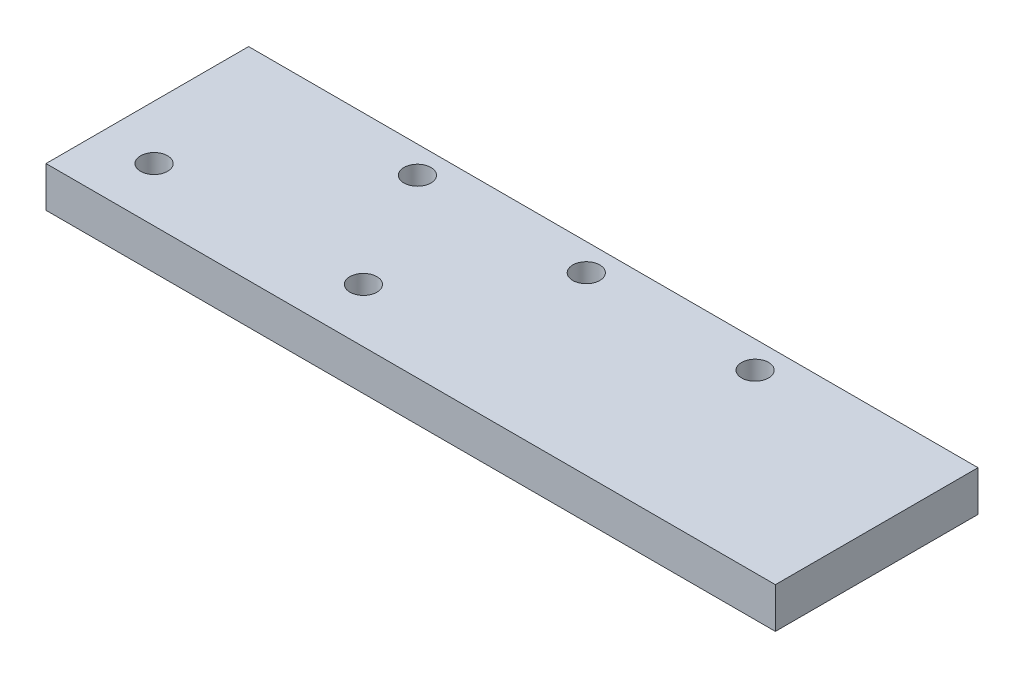
ISO-10303-21;
HEADER;
FILE_DESCRIPTION(('STEP AP214'),'2;1');
FILE_NAME('part.step','',(''),(''),'','','');
FILE_SCHEMA(('AUTOMOTIVE_DESIGN { 1 0 10303 214 1 1 1 1 }'));
ENDSEC;
DATA;
#1=APPLICATION_CONTEXT('core data for automotive mechanical design processes');
#2=APPLICATION_PROTOCOL_DEFINITION('international standard','automotive_design',2000,#1);
#3=PRODUCT_CONTEXT('',#1,'mechanical');
#4=PRODUCT('Part','Part','',(#3));
#5=PRODUCT_RELATED_PRODUCT_CATEGORY('part','',(#4));
#6=PRODUCT_DEFINITION_FORMATION('','',#4);
#7=PRODUCT_DEFINITION_CONTEXT('part definition',#1,'design');
#8=PRODUCT_DEFINITION('design','',#6,#7);
#9=PRODUCT_DEFINITION_SHAPE('','',#8);
#10=(LENGTH_UNIT() NAMED_UNIT(*) SI_UNIT(.MILLI.,.METRE.));
#11=(NAMED_UNIT(*) PLANE_ANGLE_UNIT() SI_UNIT($,.RADIAN.));
#12=(NAMED_UNIT(*) SI_UNIT($,.STERADIAN.) SOLID_ANGLE_UNIT());
#13=UNCERTAINTY_MEASURE_WITH_UNIT(LENGTH_MEASURE(1.E-05),#10,'distance_accuracy_value','');
#14=(GEOMETRIC_REPRESENTATION_CONTEXT(3) GLOBAL_UNCERTAINTY_ASSIGNED_CONTEXT((#13)) GLOBAL_UNIT_ASSIGNED_CONTEXT((#10,
#11,#12)) REPRESENTATION_CONTEXT('',''));
#15=CARTESIAN_POINT('',(0.,0.,0.));
#16=DIRECTION('',(0.,0.,1.));
#17=DIRECTION('',(1.,0.,0.));
#18=AXIS2_PLACEMENT_3D('',#15,#16,#17);
#19=CARTESIAN_POINT('',(-102.510460251046,6.,-65.1673640167364));
#20=DIRECTION('',(0.,0.,-1.));
#21=DIRECTION('',(-1.,0.,0.));
#22=AXIS2_PLACEMENT_3D('',#19,#20,#21);
#23=PLANE('',#22);
#24=DIRECTION('',(1.,0.,0.));
#25=VECTOR('',#24,1.);
#26=CARTESIAN_POINT('',(-102.510460251046,0.,-65.1673640167364));
#27=LINE('',#26,#25);
#28=CARTESIAN_POINT('',(-102.510460251046,0.,-65.1673640167364));
#29=VERTEX_POINT('',#28);
#30=CARTESIAN_POINT('',(5.48953974895393,0.,-65.1673640167364));
#31=VERTEX_POINT('',#30);
#32=EDGE_CURVE('E99',#29,#31,#27,.T.);
#33=ORIENTED_EDGE('',*,*,#32,.F.);
#34=DIRECTION('',(0.,-1.,0.));
#35=VECTOR('',#34,1.);
#36=CARTESIAN_POINT('',(-102.510460251046,6.,-65.1673640167364));
#37=LINE('',#36,#35);
#38=CARTESIAN_POINT('',(-102.510460251046,6.,-65.1673640167364));
#39=VERTEX_POINT('',#38);
#40=EDGE_CURVE('E11',#39,#29,#37,.T.);
#41=ORIENTED_EDGE('',*,*,#40,.F.);
#42=DIRECTION('',(1.,0.,0.));
#43=VECTOR('',#42,1.);
#44=CARTESIAN_POINT('',(-102.510460251046,6.,-65.1673640167364));
#45=LINE('',#44,#43);
#46=CARTESIAN_POINT('',(5.48953974895393,6.,-65.1673640167364));
#47=VERTEX_POINT('',#46);
#48=EDGE_CURVE('E93',#39,#47,#45,.T.);
#49=ORIENTED_EDGE('',*,*,#48,.T.);
#50=DIRECTION('',(0.,-1.,0.));
#51=VECTOR('',#50,1.);
#52=CARTESIAN_POINT('',(5.48953974895393,6.,-65.1673640167364));
#53=LINE('',#52,#51);
#54=EDGE_CURVE('E36',#47,#31,#53,.T.);
#55=ORIENTED_EDGE('',*,*,#54,.T.);
#56=EDGE_LOOP('',(#33,#41,#49,#55));
#57=FACE_BOUND('',#56,.T.);
#58=ADVANCED_FACE('F33',(#57),#23,.T.);
#59=CARTESIAN_POINT('',(-102.510460251046,6.,-65.1673640167364));
#60=DIRECTION('',(1.,0.,0.));
#61=DIRECTION('',(0.,0.,-1.));
#62=AXIS2_PLACEMENT_3D('',#59,#60,#61);
#63=PLANE('',#62);
#64=DIRECTION('',(0.,0.,1.));
#65=VECTOR('',#64,1.);
#66=CARTESIAN_POINT('',(-102.510460251046,0.,-65.1673640167364));
#67=LINE('',#66,#65);
#68=CARTESIAN_POINT('',(-102.510460251046,0.,-35.1673640167364));
#69=VERTEX_POINT('',#68);
#70=EDGE_CURVE('E66',#29,#69,#67,.T.);
#71=ORIENTED_EDGE('',*,*,#70,.T.);
#72=DIRECTION('',(0.,-1.,0.));
#73=VECTOR('',#72,1.);
#74=CARTESIAN_POINT('',(-102.510460251046,6.,-35.1673640167364));
#75=LINE('',#74,#73);
#76=CARTESIAN_POINT('',(-102.510460251046,6.,-35.1673640167364));
#77=VERTEX_POINT('',#76);
#78=EDGE_CURVE('E42',#77,#69,#75,.T.);
#79=ORIENTED_EDGE('',*,*,#78,.F.);
#80=DIRECTION('',(0.,0.,1.));
#81=VECTOR('',#80,1.);
#82=CARTESIAN_POINT('',(-102.510460251046,6.,-65.1673640167364));
#83=LINE('',#82,#81);
#84=EDGE_CURVE('E83',#39,#77,#83,.T.);
#85=ORIENTED_EDGE('',*,*,#84,.F.);
#86=ORIENTED_EDGE('',*,*,#40,.T.);
#87=EDGE_LOOP('',(#71,#79,#85,#86));
#88=FACE_BOUND('',#87,.T.);
#89=ADVANCED_FACE('F110',(#88),#63,.F.);
#90=CARTESIAN_POINT('',(-102.510460251046,6.,-35.1673640167364));
#91=DIRECTION('',(0.,0.,-1.));
#92=DIRECTION('',(-1.,0.,0.));
#93=AXIS2_PLACEMENT_3D('',#90,#91,#92);
#94=PLANE('',#93);
#95=DIRECTION('',(1.,0.,0.));
#96=VECTOR('',#95,1.);
#97=CARTESIAN_POINT('',(-102.510460251046,0.,-35.1673640167364));
#98=LINE('',#97,#96);
#99=CARTESIAN_POINT('',(5.48953974895393,0.,-35.1673640167364));
#100=VERTEX_POINT('',#99);
#101=EDGE_CURVE('E90',#69,#100,#98,.T.);
#102=ORIENTED_EDGE('',*,*,#101,.T.);
#103=DIRECTION('',(0.,-1.,0.));
#104=VECTOR('',#103,1.);
#105=CARTESIAN_POINT('',(5.48953974895393,6.,-35.1673640167364));
#106=LINE('',#105,#104);
#107=CARTESIAN_POINT('',(5.48953974895393,6.,-35.1673640167364));
#108=VERTEX_POINT('',#107);
#109=EDGE_CURVE('E87',#108,#100,#106,.T.);
#110=ORIENTED_EDGE('',*,*,#109,.F.);
#111=DIRECTION('',(1.,0.,0.));
#112=VECTOR('',#111,1.);
#113=CARTESIAN_POINT('',(-102.510460251046,6.,-35.1673640167364));
#114=LINE('',#113,#112);
#115=EDGE_CURVE('E78',#77,#108,#114,.T.);
#116=ORIENTED_EDGE('',*,*,#115,.F.);
#117=ORIENTED_EDGE('',*,*,#78,.T.);
#118=EDGE_LOOP('',(#102,#110,#116,#117));
#119=FACE_BOUND('',#118,.T.);
#120=ADVANCED_FACE('F88',(#119),#94,.F.);
#121=CARTESIAN_POINT('',(5.48953974895393,6.,-65.1673640167364));
#122=DIRECTION('',(1.,0.,0.));
#123=DIRECTION('',(0.,0.,-1.));
#124=AXIS2_PLACEMENT_3D('',#121,#122,#123);
#125=PLANE('',#124);
#126=DIRECTION('',(0.,0.,1.));
#127=VECTOR('',#126,1.);
#128=CARTESIAN_POINT('',(5.48953974895393,0.,-65.1673640167364));
#129=LINE('',#128,#127);
#130=EDGE_CURVE('E102',#31,#100,#129,.T.);
#131=ORIENTED_EDGE('',*,*,#130,.F.);
#132=ORIENTED_EDGE('',*,*,#54,.F.);
#133=DIRECTION('',(0.,0.,1.));
#134=VECTOR('',#133,1.);
#135=CARTESIAN_POINT('',(5.48953974895393,6.,-65.1673640167364));
#136=LINE('',#135,#134);
#137=EDGE_CURVE('E82',#47,#108,#136,.T.);
#138=ORIENTED_EDGE('',*,*,#137,.T.);
#139=ORIENTED_EDGE('',*,*,#109,.T.);
#140=EDGE_LOOP('',(#131,#132,#138,#139));
#141=FACE_BOUND('',#140,.T.);
#142=ADVANCED_FACE('F92',(#141),#125,.T.);
#143=CARTESIAN_POINT('',(0.,6.,0.));
#144=DIRECTION('',(0.,-1.,0.));
#145=DIRECTION('',(0.,0.,-1.));
#146=AXIS2_PLACEMENT_3D('',#143,#144,#145);
#147=PLANE('',#146);
#148=CARTESIAN_POINT('',(-63.5104602510461,6.,-43.1673640167364));
#149=DIRECTION('',(0.,-1.,0.));
#150=DIRECTION('',(0.,0.,-1.));
#151=AXIS2_PLACEMENT_3D('',#148,#149,#150);
#152=CIRCLE('',#151,2.);
#153=CARTESIAN_POINT('',(-63.5104602510461,6.,-45.1673640167364));
#154=VERTEX_POINT('',#153);
#155=EDGE_CURVE('E103',#154,#154,#152,.T.);
#156=ORIENTED_EDGE('',*,*,#155,.T.);
#157=EDGE_LOOP('',(#156));
#158=FACE_BOUND('',#157,.T.);
#159=CARTESIAN_POINT('',(-94.5104602510461,6.,-43.1673640167364));
#160=DIRECTION('',(0.,-1.,0.));
#161=DIRECTION('',(0.,0.,-1.));
#162=AXIS2_PLACEMENT_3D('',#159,#160,#161);
#163=CIRCLE('',#162,2.);
#164=CARTESIAN_POINT('',(-94.5104602510461,6.,-45.1673640167364));
#165=VERTEX_POINT('',#164);
#166=EDGE_CURVE('E166',#165,#165,#163,.T.);
#167=ORIENTED_EDGE('',*,*,#166,.T.);
#168=EDGE_LOOP('',(#167));
#169=FACE_BOUND('',#168,.T.);
#170=CARTESIAN_POINT('',(-23.5104602510461,6.,-61.1673640167364));
#171=DIRECTION('',(0.,-1.,0.));
#172=DIRECTION('',(0.,0.,-1.));
#173=AXIS2_PLACEMENT_3D('',#170,#171,#172);
#174=CIRCLE('',#173,2.00000000000001);
#175=CARTESIAN_POINT('',(-23.5104602510461,6.,-63.1673640167364));
#176=VERTEX_POINT('',#175);
#177=EDGE_CURVE('E162',#176,#176,#174,.T.);
#178=ORIENTED_EDGE('',*,*,#177,.T.);
#179=EDGE_LOOP('',(#178));
#180=FACE_BOUND('',#179,.T.);
#181=CARTESIAN_POINT('',(-48.5104602510461,6.,-61.1673640167364));
#182=DIRECTION('',(0.,-1.,0.));
#183=DIRECTION('',(0.,0.,-1.));
#184=AXIS2_PLACEMENT_3D('',#181,#182,#183);
#185=CIRCLE('',#184,2.);
#186=CARTESIAN_POINT('',(-48.5104602510461,6.,-63.1673640167364));
#187=VERTEX_POINT('',#186);
#188=EDGE_CURVE('E160',#187,#187,#185,.T.);
#189=ORIENTED_EDGE('',*,*,#188,.T.);
#190=EDGE_LOOP('',(#189));
#191=FACE_BOUND('',#190,.T.);
#192=CARTESIAN_POINT('',(-73.5104602510461,6.,-61.1673640167364));
#193=DIRECTION('',(0.,-1.,0.));
#194=DIRECTION('',(0.,0.,-1.));
#195=AXIS2_PLACEMENT_3D('',#192,#193,#194);
#196=CIRCLE('',#195,2.);
#197=CARTESIAN_POINT('',(-73.5104602510461,6.,-63.1673640167364));
#198=VERTEX_POINT('',#197);
#199=EDGE_CURVE('E163',#198,#198,#196,.T.);
#200=ORIENTED_EDGE('',*,*,#199,.T.);
#201=EDGE_LOOP('',(#200));
#202=FACE_BOUND('',#201,.T.);
#203=ORIENTED_EDGE('',*,*,#48,.F.);
#204=ORIENTED_EDGE('',*,*,#84,.T.);
#205=ORIENTED_EDGE('',*,*,#115,.T.);
#206=ORIENTED_EDGE('',*,*,#137,.F.);
#207=EDGE_LOOP('',(#203,#204,#205,#206));
#208=FACE_BOUND('',#207,.T.);
#209=ADVANCED_FACE('F81',(#158,#169,#180,#191,#202,#208),#147,.F.);
#210=CARTESIAN_POINT('',(0.,0.,0.));
#211=DIRECTION('',(0.,-1.,0.));
#212=DIRECTION('',(0.,0.,-1.));
#213=AXIS2_PLACEMENT_3D('',#210,#211,#212);
#214=PLANE('',#213);
#215=CARTESIAN_POINT('',(-63.5104602510461,0.,-43.1673640167364));
#216=DIRECTION('',(0.,-1.,0.));
#217=DIRECTION('',(0.,0.,-1.));
#218=AXIS2_PLACEMENT_3D('',#215,#216,#217);
#219=CIRCLE('',#218,2.);
#220=CARTESIAN_POINT('',(-63.5104602510461,0.,-45.1673640167364));
#221=VERTEX_POINT('',#220);
#222=EDGE_CURVE('E186',#221,#221,#219,.T.);
#223=ORIENTED_EDGE('',*,*,#222,.F.);
#224=EDGE_LOOP('',(#223));
#225=FACE_BOUND('',#224,.T.);
#226=CARTESIAN_POINT('',(-94.5104602510461,0.,-43.1673640167364));
#227=DIRECTION('',(0.,-1.,0.));
#228=DIRECTION('',(0.,0.,-1.));
#229=AXIS2_PLACEMENT_3D('',#226,#227,#228);
#230=CIRCLE('',#229,2.);
#231=CARTESIAN_POINT('',(-94.5104602510461,0.,-45.1673640167364));
#232=VERTEX_POINT('',#231);
#233=EDGE_CURVE('E189',#232,#232,#230,.T.);
#234=ORIENTED_EDGE('',*,*,#233,.F.);
#235=EDGE_LOOP('',(#234));
#236=FACE_BOUND('',#235,.T.);
#237=CARTESIAN_POINT('',(-23.5104602510461,0.,-61.1673640167364));
#238=DIRECTION('',(0.,-1.,0.));
#239=DIRECTION('',(0.,0.,-1.));
#240=AXIS2_PLACEMENT_3D('',#237,#238,#239);
#241=CIRCLE('',#240,2.00000000000001);
#242=CARTESIAN_POINT('',(-23.5104602510461,0.,-63.1673640167364));
#243=VERTEX_POINT('',#242);
#244=EDGE_CURVE('E192',#243,#243,#241,.T.);
#245=ORIENTED_EDGE('',*,*,#244,.F.);
#246=EDGE_LOOP('',(#245));
#247=FACE_BOUND('',#246,.T.);
#248=CARTESIAN_POINT('',(-48.5104602510461,0.,-61.1673640167364));
#249=DIRECTION('',(0.,-1.,0.));
#250=DIRECTION('',(0.,0.,-1.));
#251=AXIS2_PLACEMENT_3D('',#248,#249,#250);
#252=CIRCLE('',#251,2.);
#253=CARTESIAN_POINT('',(-48.5104602510461,0.,-63.1673640167364));
#254=VERTEX_POINT('',#253);
#255=EDGE_CURVE('E157',#254,#254,#252,.T.);
#256=ORIENTED_EDGE('',*,*,#255,.F.);
#257=EDGE_LOOP('',(#256));
#258=FACE_BOUND('',#257,.T.);
#259=CARTESIAN_POINT('',(-73.5104602510461,0.,-61.1673640167364));
#260=DIRECTION('',(0.,-1.,0.));
#261=DIRECTION('',(0.,0.,-1.));
#262=AXIS2_PLACEMENT_3D('',#259,#260,#261);
#263=CIRCLE('',#262,2.);
#264=CARTESIAN_POINT('',(-73.5104602510461,0.,-63.1673640167364));
#265=VERTEX_POINT('',#264);
#266=EDGE_CURVE('E169',#265,#265,#263,.T.);
#267=ORIENTED_EDGE('',*,*,#266,.F.);
#268=EDGE_LOOP('',(#267));
#269=FACE_BOUND('',#268,.T.);
#270=ORIENTED_EDGE('',*,*,#32,.T.);
#271=ORIENTED_EDGE('',*,*,#130,.T.);
#272=ORIENTED_EDGE('',*,*,#101,.F.);
#273=ORIENTED_EDGE('',*,*,#70,.F.);
#274=EDGE_LOOP('',(#270,#271,#272,#273));
#275=FACE_BOUND('',#274,.T.);
#276=ADVANCED_FACE('F108',(#225,#236,#247,#258,#269,#275),#214,.T.);
#277=CARTESIAN_POINT('',(-73.5104602510461,10.,-61.1673640167364));
#278=DIRECTION('',(0.,-1.,0.));
#279=DIRECTION('',(0.,0.,-1.));
#280=AXIS2_PLACEMENT_3D('',#277,#278,#279);
#281=CYLINDRICAL_SURFACE('',#280,2.);
#282=ORIENTED_EDGE('',*,*,#266,.T.);
#283=EDGE_LOOP('',(#282));
#284=FACE_BOUND('',#283,.T.);
#285=ORIENTED_EDGE('',*,*,#199,.F.);
#286=EDGE_LOOP('',(#285));
#287=FACE_BOUND('',#286,.T.);
#288=ADVANCED_FACE('F129',(#284,#287),#281,.F.);
#289=CARTESIAN_POINT('',(-48.5104602510461,10.,-61.1673640167364));
#290=DIRECTION('',(0.,-1.,0.));
#291=DIRECTION('',(0.,0.,-1.));
#292=AXIS2_PLACEMENT_3D('',#289,#290,#291);
#293=CYLINDRICAL_SURFACE('',#292,2.);
#294=ORIENTED_EDGE('',*,*,#255,.T.);
#295=EDGE_LOOP('',(#294));
#296=FACE_BOUND('',#295,.T.);
#297=ORIENTED_EDGE('',*,*,#188,.F.);
#298=EDGE_LOOP('',(#297));
#299=FACE_BOUND('',#298,.T.);
#300=ADVANCED_FACE('F136',(#296,#299),#293,.F.);
#301=CARTESIAN_POINT('',(-23.5104602510461,10.,-61.1673640167364));
#302=DIRECTION('',(0.,-1.,0.));
#303=DIRECTION('',(0.,0.,-1.));
#304=AXIS2_PLACEMENT_3D('',#301,#302,#303);
#305=CYLINDRICAL_SURFACE('',#304,2.00000000000001);
#306=ORIENTED_EDGE('',*,*,#244,.T.);
#307=EDGE_LOOP('',(#306));
#308=FACE_BOUND('',#307,.T.);
#309=ORIENTED_EDGE('',*,*,#177,.F.);
#310=EDGE_LOOP('',(#309));
#311=FACE_BOUND('',#310,.T.);
#312=ADVANCED_FACE('F145',(#308,#311),#305,.F.);
#313=CARTESIAN_POINT('',(-94.5104602510461,10.,-43.1673640167364));
#314=DIRECTION('',(0.,-1.,0.));
#315=DIRECTION('',(0.,0.,-1.));
#316=AXIS2_PLACEMENT_3D('',#313,#314,#315);
#317=CYLINDRICAL_SURFACE('',#316,2.);
#318=ORIENTED_EDGE('',*,*,#233,.T.);
#319=EDGE_LOOP('',(#318));
#320=FACE_BOUND('',#319,.T.);
#321=ORIENTED_EDGE('',*,*,#166,.F.);
#322=EDGE_LOOP('',(#321));
#323=FACE_BOUND('',#322,.T.);
#324=ADVANCED_FACE('F141',(#320,#323),#317,.F.);
#325=CARTESIAN_POINT('',(-63.5104602510461,10.,-43.1673640167364));
#326=DIRECTION('',(0.,-1.,0.));
#327=DIRECTION('',(0.,0.,-1.));
#328=AXIS2_PLACEMENT_3D('',#325,#326,#327);
#329=CYLINDRICAL_SURFACE('',#328,2.);
#330=ORIENTED_EDGE('',*,*,#222,.T.);
#331=EDGE_LOOP('',(#330));
#332=FACE_BOUND('',#331,.T.);
#333=ORIENTED_EDGE('',*,*,#155,.F.);
#334=EDGE_LOOP('',(#333));
#335=FACE_BOUND('',#334,.T.);
#336=ADVANCED_FACE('F138',(#332,#335),#329,.F.);
#337=CLOSED_SHELL('',(#58,#89,#120,#142,#209,#276,#288,#300,#312,#324,#336));
#338=MANIFOLD_SOLID_BREP('B2',#337);
#339=ADVANCED_BREP_SHAPE_REPRESENTATION('',(#18,#338),#14);
#340=SHAPE_DEFINITION_REPRESENTATION(#9,#339);
ENDSEC;
END-ISO-10303-21;
